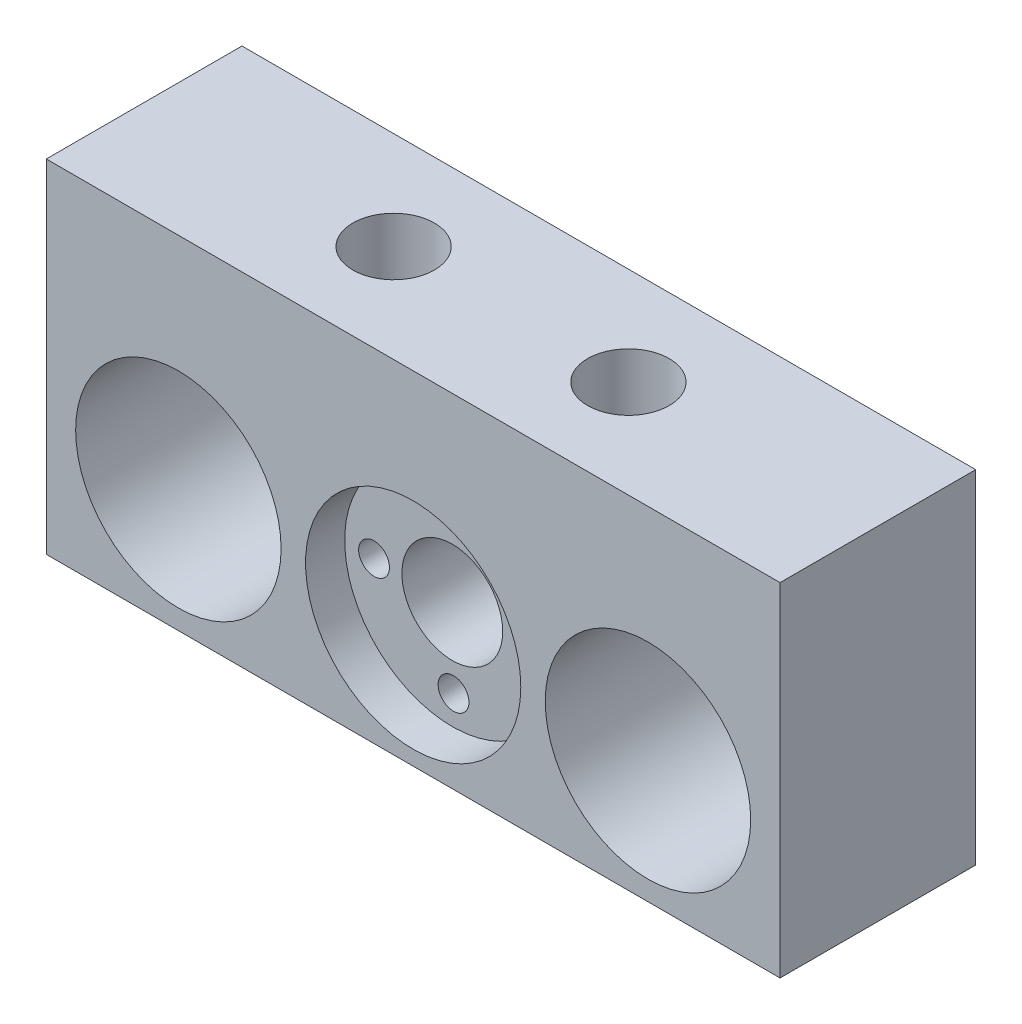
ISO-10303-21;
HEADER;
FILE_DESCRIPTION(('STEP AP214'),'2;1');
FILE_NAME('part.step','',(''),(''),'','','');
FILE_SCHEMA(('AUTOMOTIVE_DESIGN { 1 0 10303 214 1 1 1 1 }'));
ENDSEC;
DATA;
#1=APPLICATION_CONTEXT('core data for automotive mechanical design processes');
#2=APPLICATION_PROTOCOL_DEFINITION('international standard','automotive_design',2000,#1);
#3=PRODUCT_CONTEXT('',#1,'mechanical');
#4=PRODUCT('Part','Part','',(#3));
#5=PRODUCT_RELATED_PRODUCT_CATEGORY('part','',(#4));
#6=PRODUCT_DEFINITION_FORMATION('','',#4);
#7=PRODUCT_DEFINITION_CONTEXT('part definition',#1,'design');
#8=PRODUCT_DEFINITION('design','',#6,#7);
#9=PRODUCT_DEFINITION_SHAPE('','',#8);
#10=(LENGTH_UNIT() NAMED_UNIT(*) SI_UNIT(.MILLI.,.METRE.));
#11=(NAMED_UNIT(*) PLANE_ANGLE_UNIT() SI_UNIT($,.RADIAN.));
#12=(NAMED_UNIT(*) SI_UNIT($,.STERADIAN.) SOLID_ANGLE_UNIT());
#13=UNCERTAINTY_MEASURE_WITH_UNIT(LENGTH_MEASURE(1.E-05),#10,'distance_accuracy_value','');
#14=(GEOMETRIC_REPRESENTATION_CONTEXT(3) GLOBAL_UNCERTAINTY_ASSIGNED_CONTEXT((#13)) GLOBAL_UNIT_ASSIGNED_CONTEXT((#10,
#11,#12)) REPRESENTATION_CONTEXT('',''));
#15=CARTESIAN_POINT('',(0.,0.,0.));
#16=DIRECTION('',(0.,0.,1.));
#17=DIRECTION('',(1.,0.,0.));
#18=AXIS2_PLACEMENT_3D('',#15,#16,#17);
#19=CARTESIAN_POINT('',(0.,-5.,0.));
#20=DIRECTION('',(0.,0.,1.));
#21=DIRECTION('',(1.,0.,0.));
#22=AXIS2_PLACEMENT_3D('',#19,#20,#21);
#23=CYLINDRICAL_SURFACE('',#22,5.15);
#24=CARTESIAN_POINT('',(0.,-5.,0.));
#25=DIRECTION('',(0.,0.,1.));
#26=DIRECTION('',(1.,0.,0.));
#27=AXIS2_PLACEMENT_3D('',#24,#25,#26);
#28=CIRCLE('',#27,5.15);
#29=CARTESIAN_POINT('',(5.15,-5.,0.));
#30=VERTEX_POINT('',#29);
#31=EDGE_CURVE('E163',#30,#30,#28,.T.);
#32=ORIENTED_EDGE('',*,*,#31,.F.);
#33=EDGE_LOOP('',(#32));
#34=FACE_BOUND('',#33,.T.);
#35=CARTESIAN_POINT('',(0.,-5.,16.));
#36=DIRECTION('',(0.,0.,1.));
#37=DIRECTION('',(1.,0.,0.));
#38=AXIS2_PLACEMENT_3D('',#35,#36,#37);
#39=CIRCLE('',#38,5.15);
#40=CARTESIAN_POINT('',(5.15,-5.,16.));
#41=VERTEX_POINT('',#40);
#42=EDGE_CURVE('E41',#41,#41,#39,.F.);
#43=ORIENTED_EDGE('',*,*,#42,.F.);
#44=EDGE_LOOP('',(#43));
#45=FACE_BOUND('',#44,.T.);
#46=ADVANCED_FACE('F37',(#34,#45),#23,.F.);
#47=CARTESIAN_POINT('',(-37.5,-17.5,20.));
#48=DIRECTION('',(1.,0.,0.));
#49=DIRECTION('',(0.,0.,-1.));
#50=AXIS2_PLACEMENT_3D('',#47,#48,#49);
#51=PLANE('',#50);
#52=DIRECTION('',(0.,-1.,0.));
#53=VECTOR('',#52,1.);
#54=CARTESIAN_POINT('',(-37.5,-17.5,0.));
#55=LINE('',#54,#53);
#56=CARTESIAN_POINT('',(-37.5,17.5,0.));
#57=VERTEX_POINT('',#56);
#58=CARTESIAN_POINT('',(-37.5,-17.5,0.));
#59=VERTEX_POINT('',#58);
#60=EDGE_CURVE('E159',#57,#59,#55,.T.);
#61=ORIENTED_EDGE('',*,*,#60,.T.);
#62=DIRECTION('',(0.,0.,-1.));
#63=VECTOR('',#62,1.);
#64=CARTESIAN_POINT('',(-37.5,-17.5,20.));
#65=LINE('',#64,#63);
#66=CARTESIAN_POINT('',(-37.5,-17.5,20.));
#67=VERTEX_POINT('',#66);
#68=EDGE_CURVE('E11',#67,#59,#65,.T.);
#69=ORIENTED_EDGE('',*,*,#68,.F.);
#70=DIRECTION('',(0.,-1.,0.));
#71=VECTOR('',#70,1.);
#72=CARTESIAN_POINT('',(-37.5,-17.5,20.));
#73=LINE('',#72,#71);
#74=CARTESIAN_POINT('',(-37.5,17.5,20.));
#75=VERTEX_POINT('',#74);
#76=EDGE_CURVE('E172',#75,#67,#73,.T.);
#77=ORIENTED_EDGE('',*,*,#76,.F.);
#78=DIRECTION('',(0.,0.,-1.));
#79=VECTOR('',#78,1.);
#80=CARTESIAN_POINT('',(-37.5,17.5,20.));
#81=LINE('',#80,#79);
#82=EDGE_CURVE('E178',#75,#57,#81,.T.);
#83=ORIENTED_EDGE('',*,*,#82,.T.);
#84=EDGE_LOOP('',(#61,#69,#77,#83));
#85=FACE_BOUND('',#84,.T.);
#86=ADVANCED_FACE('F39',(#85),#51,.F.);
#87=CARTESIAN_POINT('',(37.5,-17.5,20.));
#88=DIRECTION('',(0.,1.,0.));
#89=DIRECTION('',(-1.,0.,0.));
#90=AXIS2_PLACEMENT_3D('',#87,#88,#89);
#91=PLANE('',#90);
#92=DIRECTION('',(1.,0.,0.));
#93=VECTOR('',#92,1.);
#94=CARTESIAN_POINT('',(37.5,-17.5,0.));
#95=LINE('',#94,#93);
#96=CARTESIAN_POINT('',(37.5,-17.5,0.));
#97=VERTEX_POINT('',#96);
#98=EDGE_CURVE('E181',#59,#97,#95,.T.);
#99=ORIENTED_EDGE('',*,*,#98,.T.);
#100=DIRECTION('',(0.,0.,-1.));
#101=VECTOR('',#100,1.);
#102=CARTESIAN_POINT('',(37.5,-17.5,20.));
#103=LINE('',#102,#101);
#104=CARTESIAN_POINT('',(37.5,-17.5,20.));
#105=VERTEX_POINT('',#104);
#106=EDGE_CURVE('E47',#105,#97,#103,.T.);
#107=ORIENTED_EDGE('',*,*,#106,.F.);
#108=DIRECTION('',(1.,0.,0.));
#109=VECTOR('',#108,1.);
#110=CARTESIAN_POINT('',(37.5,-17.5,20.));
#111=LINE('',#110,#109);
#112=EDGE_CURVE('E86',#67,#105,#111,.T.);
#113=ORIENTED_EDGE('',*,*,#112,.F.);
#114=ORIENTED_EDGE('',*,*,#68,.T.);
#115=EDGE_LOOP('',(#99,#107,#113,#114));
#116=FACE_BOUND('',#115,.T.);
#117=ADVANCED_FACE('F207',(#116),#91,.F.);
#118=CARTESIAN_POINT('',(37.5,-17.5,20.));
#119=DIRECTION('',(-1.,0.,0.));
#120=DIRECTION('',(0.,0.,1.));
#121=AXIS2_PLACEMENT_3D('',#118,#119,#120);
#122=PLANE('',#121);
#123=DIRECTION('',(0.,1.,0.));
#124=VECTOR('',#123,1.);
#125=CARTESIAN_POINT('',(37.5,-17.5,0.));
#126=LINE('',#125,#124);
#127=CARTESIAN_POINT('',(37.5,17.5,0.));
#128=VERTEX_POINT('',#127);
#129=EDGE_CURVE('E73',#97,#128,#126,.T.);
#130=ORIENTED_EDGE('',*,*,#129,.T.);
#131=DIRECTION('',(0.,0.,-1.));
#132=VECTOR('',#131,1.);
#133=CARTESIAN_POINT('',(37.5,17.5,20.));
#134=LINE('',#133,#132);
#135=CARTESIAN_POINT('',(37.5,17.5,20.));
#136=VERTEX_POINT('',#135);
#137=EDGE_CURVE('E186',#136,#128,#134,.T.);
#138=ORIENTED_EDGE('',*,*,#137,.F.);
#139=DIRECTION('',(0.,1.,0.));
#140=VECTOR('',#139,1.);
#141=CARTESIAN_POINT('',(37.5,-17.5,20.));
#142=LINE('',#141,#140);
#143=EDGE_CURVE('E175',#105,#136,#142,.T.);
#144=ORIENTED_EDGE('',*,*,#143,.F.);
#145=ORIENTED_EDGE('',*,*,#106,.T.);
#146=EDGE_LOOP('',(#130,#138,#144,#145));
#147=FACE_BOUND('',#146,.T.);
#148=ADVANCED_FACE('F189',(#147),#122,.F.);
#149=CARTESIAN_POINT('',(37.5,17.5,20.));
#150=DIRECTION('',(0.,-1.,0.));
#151=DIRECTION('',(1.,0.,0.));
#152=AXIS2_PLACEMENT_3D('',#149,#150,#151);
#153=PLANE('',#152);
#154=CARTESIAN_POINT('',(-12.,17.5,10.));
#155=DIRECTION('',(0.,1.,0.));
#156=DIRECTION('',(0.,0.,1.));
#157=AXIS2_PLACEMENT_3D('',#154,#155,#156);
#158=CIRCLE('',#157,4.16687);
#159=CARTESIAN_POINT('',(-12.,17.5,14.16687));
#160=VERTEX_POINT('',#159);
#161=EDGE_CURVE('E116',#160,#160,#158,.T.);
#162=ORIENTED_EDGE('',*,*,#161,.F.);
#163=EDGE_LOOP('',(#162));
#164=FACE_BOUND('',#163,.T.);
#165=CARTESIAN_POINT('',(12.,17.5,10.));
#166=DIRECTION('',(0.,1.,0.));
#167=DIRECTION('',(0.,0.,1.));
#168=AXIS2_PLACEMENT_3D('',#165,#166,#167);
#169=CIRCLE('',#168,4.16687);
#170=CARTESIAN_POINT('',(12.,17.5,14.16687));
#171=VERTEX_POINT('',#170);
#172=EDGE_CURVE('E115',#171,#171,#169,.T.);
#173=ORIENTED_EDGE('',*,*,#172,.F.);
#174=EDGE_LOOP('',(#173));
#175=FACE_BOUND('',#174,.T.);
#176=DIRECTION('',(-1.,0.,0.));
#177=VECTOR('',#176,1.);
#178=CARTESIAN_POINT('',(37.5,17.5,0.));
#179=LINE('',#178,#177);
#180=EDGE_CURVE('E79',#128,#57,#179,.T.);
#181=ORIENTED_EDGE('',*,*,#180,.T.);
#182=ORIENTED_EDGE('',*,*,#82,.F.);
#183=DIRECTION('',(-1.,0.,0.));
#184=VECTOR('',#183,1.);
#185=CARTESIAN_POINT('',(37.5,17.5,20.));
#186=LINE('',#185,#184);
#187=EDGE_CURVE('E55',#136,#75,#186,.T.);
#188=ORIENTED_EDGE('',*,*,#187,.F.);
#189=ORIENTED_EDGE('',*,*,#137,.T.);
#190=EDGE_LOOP('',(#181,#182,#188,#189));
#191=FACE_BOUND('',#190,.T.);
#192=ADVANCED_FACE('F196',(#164,#175,#191),#153,.F.);
#193=CARTESIAN_POINT('',(0.,0.,20.));
#194=DIRECTION('',(0.,0.,1.));
#195=DIRECTION('',(1.,0.,0.));
#196=AXIS2_PLACEMENT_3D('',#193,#194,#195);
#197=PLANE('',#196);
#198=CARTESIAN_POINT('',(0.,-5.,20.));
#199=DIRECTION('',(0.,0.,1.));
#200=DIRECTION('',(1.,0.,0.));
#201=AXIS2_PLACEMENT_3D('',#198,#199,#200);
#202=CIRCLE('',#201,11.);
#203=CARTESIAN_POINT('',(11.,-5.,20.));
#204=VERTEX_POINT('',#203);
#205=EDGE_CURVE('E150',#204,#204,#202,.T.);
#206=ORIENTED_EDGE('',*,*,#205,.F.);
#207=EDGE_LOOP('',(#206));
#208=FACE_BOUND('',#207,.T.);
#209=CARTESIAN_POINT('',(-24.,-5.,20.));
#210=DIRECTION('',(0.,0.,1.));
#211=DIRECTION('',(1.,0.,0.));
#212=AXIS2_PLACEMENT_3D('',#209,#210,#211);
#213=CIRCLE('',#212,10.5);
#214=CARTESIAN_POINT('',(-13.5,-5.,20.));
#215=VERTEX_POINT('',#214);
#216=EDGE_CURVE('E160',#215,#215,#213,.T.);
#217=ORIENTED_EDGE('',*,*,#216,.F.);
#218=EDGE_LOOP('',(#217));
#219=FACE_BOUND('',#218,.T.);
#220=CARTESIAN_POINT('',(24.,-5.,20.));
#221=DIRECTION('',(0.,0.,1.));
#222=DIRECTION('',(-1.,0.,0.));
#223=AXIS2_PLACEMENT_3D('',#220,#221,#222);
#224=CIRCLE('',#223,10.5);
#225=CARTESIAN_POINT('',(13.5,-5.,20.));
#226=VERTEX_POINT('',#225);
#227=EDGE_CURVE('E169',#226,#226,#224,.T.);
#228=ORIENTED_EDGE('',*,*,#227,.F.);
#229=EDGE_LOOP('',(#228));
#230=FACE_BOUND('',#229,.T.);
#231=ORIENTED_EDGE('',*,*,#76,.T.);
#232=ORIENTED_EDGE('',*,*,#112,.T.);
#233=ORIENTED_EDGE('',*,*,#143,.T.);
#234=ORIENTED_EDGE('',*,*,#187,.T.);
#235=EDGE_LOOP('',(#231,#232,#233,#234));
#236=FACE_BOUND('',#235,.T.);
#237=ADVANCED_FACE('F198',(#208,#219,#230,#236),#197,.T.);
#238=CARTESIAN_POINT('',(0.,0.,0.));
#239=DIRECTION('',(0.,0.,1.));
#240=DIRECTION('',(1.,0.,0.));
#241=AXIS2_PLACEMENT_3D('',#238,#239,#240);
#242=PLANE('',#241);
#243=CARTESIAN_POINT('',(-24.,-5.,0.));
#244=DIRECTION('',(0.,0.,1.));
#245=DIRECTION('',(1.,0.,0.));
#246=AXIS2_PLACEMENT_3D('',#243,#244,#245);
#247=CIRCLE('',#246,10.5);
#248=CARTESIAN_POINT('',(-13.5,-5.,0.));
#249=VERTEX_POINT('',#248);
#250=EDGE_CURVE('E156',#249,#249,#247,.T.);
#251=ORIENTED_EDGE('',*,*,#250,.T.);
#252=EDGE_LOOP('',(#251));
#253=FACE_BOUND('',#252,.T.);
#254=ORIENTED_EDGE('',*,*,#31,.T.);
#255=EDGE_LOOP('',(#254));
#256=FACE_BOUND('',#255,.T.);
#257=CARTESIAN_POINT('',(24.,-5.,0.));
#258=DIRECTION('',(0.,0.,1.));
#259=DIRECTION('',(-1.,0.,0.));
#260=AXIS2_PLACEMENT_3D('',#257,#258,#259);
#261=CIRCLE('',#260,10.5);
#262=CARTESIAN_POINT('',(13.5,-5.,0.));
#263=VERTEX_POINT('',#262);
#264=EDGE_CURVE('E166',#263,#263,#261,.T.);
#265=ORIENTED_EDGE('',*,*,#264,.T.);
#266=EDGE_LOOP('',(#265));
#267=FACE_BOUND('',#266,.T.);
#268=ORIENTED_EDGE('',*,*,#60,.F.);
#269=ORIENTED_EDGE('',*,*,#180,.F.);
#270=ORIENTED_EDGE('',*,*,#129,.F.);
#271=ORIENTED_EDGE('',*,*,#98,.F.);
#272=EDGE_LOOP('',(#268,#269,#270,#271));
#273=FACE_BOUND('',#272,.T.);
#274=ADVANCED_FACE('F192',(#253,#256,#267,#273),#242,.F.);
#275=CARTESIAN_POINT('',(24.,-5.,0.));
#276=DIRECTION('',(0.,0.,1.));
#277=DIRECTION('',(1.,0.,0.));
#278=AXIS2_PLACEMENT_3D('',#275,#276,#277);
#279=CYLINDRICAL_SURFACE('',#278,10.5);
#280=ORIENTED_EDGE('',*,*,#264,.F.);
#281=EDGE_LOOP('',(#280));
#282=FACE_BOUND('',#281,.T.);
#283=ORIENTED_EDGE('',*,*,#227,.T.);
#284=EDGE_LOOP('',(#283));
#285=FACE_BOUND('',#284,.T.);
#286=ADVANCED_FACE('F224',(#282,#285),#279,.F.);
#287=CARTESIAN_POINT('',(-24.,-5.,0.));
#288=DIRECTION('',(0.,0.,1.));
#289=DIRECTION('',(1.,0.,0.));
#290=AXIS2_PLACEMENT_3D('',#287,#288,#289);
#291=CYLINDRICAL_SURFACE('',#290,10.5);
#292=ORIENTED_EDGE('',*,*,#250,.F.);
#293=EDGE_LOOP('',(#292));
#294=FACE_BOUND('',#293,.T.);
#295=ORIENTED_EDGE('',*,*,#216,.T.);
#296=EDGE_LOOP('',(#295));
#297=FACE_BOUND('',#296,.T.);
#298=ADVANCED_FACE('F222',(#294,#297),#291,.F.);
#299=CARTESIAN_POINT('',(0.,-5.,16.));
#300=DIRECTION('',(0.,0.,1.));
#301=DIRECTION('',(1.,0.,0.));
#302=AXIS2_PLACEMENT_3D('',#299,#300,#301);
#303=PLANE('',#302);
#304=CARTESIAN_POINT('',(-8.,-5.12563555532117,16.));
#305=DIRECTION('',(0.,0.,1.));
#306=DIRECTION('',(1.,0.,0.));
#307=AXIS2_PLACEMENT_3D('',#304,#305,#306);
#308=CIRCLE('',#307,1.575);
#309=CARTESIAN_POINT('',(-6.425,-5.12563555532117,16.));
#310=VERTEX_POINT('',#309);
#311=EDGE_CURVE('E126',#310,#310,#308,.T.);
#312=ORIENTED_EDGE('',*,*,#311,.F.);
#313=EDGE_LOOP('',(#312));
#314=FACE_BOUND('',#313,.T.);
#315=CARTESIAN_POINT('',(-0.125635555321142,3.,16.));
#316=DIRECTION('',(0.,0.,1.));
#317=DIRECTION('',(1.,0.,0.));
#318=AXIS2_PLACEMENT_3D('',#315,#316,#317);
#319=CIRCLE('',#318,1.575);
#320=CARTESIAN_POINT('',(1.44936444467886,3.,16.));
#321=VERTEX_POINT('',#320);
#322=EDGE_CURVE('E132',#321,#321,#319,.T.);
#323=ORIENTED_EDGE('',*,*,#322,.F.);
#324=EDGE_LOOP('',(#323));
#325=FACE_BOUND('',#324,.T.);
#326=CARTESIAN_POINT('',(8.,-4.87436444467889,16.));
#327=DIRECTION('',(0.,0.,1.));
#328=DIRECTION('',(1.,0.,0.));
#329=AXIS2_PLACEMENT_3D('',#326,#327,#328);
#330=CIRCLE('',#329,1.575);
#331=CARTESIAN_POINT('',(9.575,-4.87436444467889,16.));
#332=VERTEX_POINT('',#331);
#333=EDGE_CURVE('E138',#332,#332,#330,.T.);
#334=ORIENTED_EDGE('',*,*,#333,.F.);
#335=EDGE_LOOP('',(#334));
#336=FACE_BOUND('',#335,.T.);
#337=CARTESIAN_POINT('',(0.125635555321082,-13.,16.));
#338=DIRECTION('',(0.,0.,1.));
#339=DIRECTION('',(1.,0.,0.));
#340=AXIS2_PLACEMENT_3D('',#337,#338,#339);
#341=CIRCLE('',#340,1.575);
#342=CARTESIAN_POINT('',(1.70063555532108,-13.,16.));
#343=VERTEX_POINT('',#342);
#344=EDGE_CURVE('E144',#343,#343,#341,.T.);
#345=ORIENTED_EDGE('',*,*,#344,.F.);
#346=EDGE_LOOP('',(#345));
#347=FACE_BOUND('',#346,.T.);
#348=CARTESIAN_POINT('',(0.,-5.,16.));
#349=DIRECTION('',(0.,0.,1.));
#350=DIRECTION('',(1.,0.,0.));
#351=AXIS2_PLACEMENT_3D('',#348,#349,#350);
#352=CIRCLE('',#351,11.);
#353=CARTESIAN_POINT('',(11.,-5.,16.));
#354=VERTEX_POINT('',#353);
#355=EDGE_CURVE('E151',#354,#354,#352,.T.);
#356=ORIENTED_EDGE('',*,*,#355,.T.);
#357=EDGE_LOOP('',(#356));
#358=FACE_BOUND('',#357,.T.);
#359=ORIENTED_EDGE('',*,*,#42,.T.);
#360=EDGE_LOOP('',(#359));
#361=FACE_BOUND('',#360,.T.);
#362=ADVANCED_FACE('F241',(#314,#325,#336,#347,#358,#361),#303,.T.);
#363=CARTESIAN_POINT('',(0.,-5.,16.));
#364=DIRECTION('',(0.,0.,1.));
#365=DIRECTION('',(1.,0.,0.));
#366=AXIS2_PLACEMENT_3D('',#363,#364,#365);
#367=CYLINDRICAL_SURFACE('',#366,11.);
#368=ORIENTED_EDGE('',*,*,#355,.F.);
#369=EDGE_LOOP('',(#368));
#370=FACE_BOUND('',#369,.T.);
#371=ORIENTED_EDGE('',*,*,#205,.T.);
#372=EDGE_LOOP('',(#371));
#373=FACE_BOUND('',#372,.T.);
#374=ADVANCED_FACE('F247',(#370,#373),#367,.F.);
#375=CARTESIAN_POINT('',(0.125635555321082,-13.,6.));
#376=DIRECTION('',(0.,0.,1.));
#377=DIRECTION('',(1.,0.,0.));
#378=AXIS2_PLACEMENT_3D('',#375,#376,#377);
#379=CONICAL_SURFACE('',#378,1.575,1.02974425867665);
#380=CARTESIAN_POINT('',(0.12563555532108,-13.,5.05364452503159));
#381=VERTEX_POINT('',#380);
#382=VERTEX_LOOP('',#381);
#383=FACE_BOUND('',#382,.T.);
#384=CARTESIAN_POINT('',(0.125635555321082,-13.,6.));
#385=DIRECTION('',(0.,0.,1.));
#386=DIRECTION('',(1.,0.,0.));
#387=AXIS2_PLACEMENT_3D('',#384,#385,#386);
#388=CIRCLE('',#387,1.575);
#389=CARTESIAN_POINT('',(1.70063555532108,-13.,6.));
#390=VERTEX_POINT('',#389);
#391=EDGE_CURVE('E147',#390,#390,#388,.T.);
#392=ORIENTED_EDGE('',*,*,#391,.T.);
#393=EDGE_LOOP('',(#392));
#394=FACE_BOUND('',#393,.T.);
#395=ADVANCED_FACE('F253',(#383,#394),#379,.F.);
#396=CARTESIAN_POINT('',(0.125635555321082,-13.,16.));
#397=DIRECTION('',(0.,0.,1.));
#398=DIRECTION('',(1.,0.,0.));
#399=AXIS2_PLACEMENT_3D('',#396,#397,#398);
#400=CYLINDRICAL_SURFACE('',#399,1.575);
#401=ORIENTED_EDGE('',*,*,#391,.F.);
#402=EDGE_LOOP('',(#401));
#403=FACE_BOUND('',#402,.T.);
#404=ORIENTED_EDGE('',*,*,#344,.T.);
#405=EDGE_LOOP('',(#404));
#406=FACE_BOUND('',#405,.T.);
#407=ADVANCED_FACE('F260',(#403,#406),#400,.F.);
#408=CARTESIAN_POINT('',(8.,-4.87436444467889,6.));
#409=DIRECTION('',(0.,0.,1.));
#410=DIRECTION('',(1.,0.,0.));
#411=AXIS2_PLACEMENT_3D('',#408,#409,#410);
#412=CONICAL_SURFACE('',#411,1.575,1.02974425867665);
#413=CARTESIAN_POINT('',(7.99999999999999,-4.87436444467889,5.05364452503159));
#414=VERTEX_POINT('',#413);
#415=VERTEX_LOOP('',#414);
#416=FACE_BOUND('',#415,.T.);
#417=CARTESIAN_POINT('',(8.,-4.87436444467889,6.));
#418=DIRECTION('',(0.,0.,1.));
#419=DIRECTION('',(1.,0.,0.));
#420=AXIS2_PLACEMENT_3D('',#417,#418,#419);
#421=CIRCLE('',#420,1.575);
#422=CARTESIAN_POINT('',(9.575,-4.87436444467889,6.));
#423=VERTEX_POINT('',#422);
#424=EDGE_CURVE('E141',#423,#423,#421,.T.);
#425=ORIENTED_EDGE('',*,*,#424,.T.);
#426=EDGE_LOOP('',(#425));
#427=FACE_BOUND('',#426,.T.);
#428=ADVANCED_FACE('F264',(#416,#427),#412,.F.);
#429=CARTESIAN_POINT('',(8.,-4.87436444467889,16.));
#430=DIRECTION('',(0.,0.,1.));
#431=DIRECTION('',(1.,0.,0.));
#432=AXIS2_PLACEMENT_3D('',#429,#430,#431);
#433=CYLINDRICAL_SURFACE('',#432,1.575);
#434=ORIENTED_EDGE('',*,*,#424,.F.);
#435=EDGE_LOOP('',(#434));
#436=FACE_BOUND('',#435,.T.);
#437=ORIENTED_EDGE('',*,*,#333,.T.);
#438=EDGE_LOOP('',(#437));
#439=FACE_BOUND('',#438,.T.);
#440=ADVANCED_FACE('F268',(#436,#439),#433,.F.);
#441=CARTESIAN_POINT('',(-0.125635555321142,3.,6.));
#442=DIRECTION('',(0.,0.,1.));
#443=DIRECTION('',(1.,0.,0.));
#444=AXIS2_PLACEMENT_3D('',#441,#442,#443);
#445=CONICAL_SURFACE('',#444,1.575,1.02974425867665);
#446=CARTESIAN_POINT('',(-0.125635555321145,3.,5.05364452503159));
#447=VERTEX_POINT('',#446);
#448=VERTEX_LOOP('',#447);
#449=FACE_BOUND('',#448,.T.);
#450=CARTESIAN_POINT('',(-0.125635555321142,3.,6.));
#451=DIRECTION('',(0.,0.,1.));
#452=DIRECTION('',(1.,0.,0.));
#453=AXIS2_PLACEMENT_3D('',#450,#451,#452);
#454=CIRCLE('',#453,1.575);
#455=CARTESIAN_POINT('',(1.44936444467886,3.,6.));
#456=VERTEX_POINT('',#455);
#457=EDGE_CURVE('E135',#456,#456,#454,.T.);
#458=ORIENTED_EDGE('',*,*,#457,.T.);
#459=EDGE_LOOP('',(#458));
#460=FACE_BOUND('',#459,.T.);
#461=ADVANCED_FACE('F272',(#449,#460),#445,.F.);
#462=CARTESIAN_POINT('',(-0.125635555321142,3.,16.));
#463=DIRECTION('',(0.,0.,1.));
#464=DIRECTION('',(1.,0.,0.));
#465=AXIS2_PLACEMENT_3D('',#462,#463,#464);
#466=CYLINDRICAL_SURFACE('',#465,1.575);
#467=ORIENTED_EDGE('',*,*,#457,.F.);
#468=EDGE_LOOP('',(#467));
#469=FACE_BOUND('',#468,.T.);
#470=ORIENTED_EDGE('',*,*,#322,.T.);
#471=EDGE_LOOP('',(#470));
#472=FACE_BOUND('',#471,.T.);
#473=ADVANCED_FACE('F276',(#469,#472),#466,.F.);
#474=CARTESIAN_POINT('',(-8.,-5.12563555532117,6.));
#475=DIRECTION('',(0.,0.,1.));
#476=DIRECTION('',(1.,0.,0.));
#477=AXIS2_PLACEMENT_3D('',#474,#475,#476);
#478=CONICAL_SURFACE('',#477,1.575,1.02974425867665);
#479=CARTESIAN_POINT('',(-8.,-5.12563555532117,5.05364452503159));
#480=VERTEX_POINT('',#479);
#481=VERTEX_LOOP('',#480);
#482=FACE_BOUND('',#481,.T.);
#483=CARTESIAN_POINT('',(-8.,-5.12563555532117,6.));
#484=DIRECTION('',(0.,0.,1.));
#485=DIRECTION('',(1.,0.,0.));
#486=AXIS2_PLACEMENT_3D('',#483,#484,#485);
#487=CIRCLE('',#486,1.575);
#488=CARTESIAN_POINT('',(-6.425,-5.12563555532117,6.));
#489=VERTEX_POINT('',#488);
#490=EDGE_CURVE('E129',#489,#489,#487,.T.);
#491=ORIENTED_EDGE('',*,*,#490,.T.);
#492=EDGE_LOOP('',(#491));
#493=FACE_BOUND('',#492,.T.);
#494=ADVANCED_FACE('F280',(#482,#493),#478,.F.);
#495=CARTESIAN_POINT('',(-8.,-5.12563555532117,16.));
#496=DIRECTION('',(0.,0.,1.));
#497=DIRECTION('',(1.,0.,0.));
#498=AXIS2_PLACEMENT_3D('',#495,#496,#497);
#499=CYLINDRICAL_SURFACE('',#498,1.575);
#500=ORIENTED_EDGE('',*,*,#490,.F.);
#501=EDGE_LOOP('',(#500));
#502=FACE_BOUND('',#501,.T.);
#503=ORIENTED_EDGE('',*,*,#311,.T.);
#504=EDGE_LOOP('',(#503));
#505=FACE_BOUND('',#504,.T.);
#506=ADVANCED_FACE('F284',(#502,#505),#499,.F.);
#507=CARTESIAN_POINT('',(12.,5.50000000000001,10.));
#508=DIRECTION('',(0.,1.,0.));
#509=DIRECTION('',(0.,0.,1.));
#510=AXIS2_PLACEMENT_3D('',#507,#508,#509);
#511=CONICAL_SURFACE('',#510,4.16687,1.02974425867665);
#512=CARTESIAN_POINT('',(12.,2.99629191239263,10.));
#513=VERTEX_POINT('',#512);
#514=VERTEX_LOOP('',#513);
#515=FACE_BOUND('',#514,.T.);
#516=CARTESIAN_POINT('',(12.,5.50000000000001,10.));
#517=DIRECTION('',(0.,1.,0.));
#518=DIRECTION('',(0.,0.,1.));
#519=AXIS2_PLACEMENT_3D('',#516,#517,#518);
#520=CIRCLE('',#519,4.16687);
#521=CARTESIAN_POINT('',(12.,5.50000000000001,14.16687));
#522=VERTEX_POINT('',#521);
#523=EDGE_CURVE('E119',#522,#522,#520,.T.);
#524=ORIENTED_EDGE('',*,*,#523,.T.);
#525=EDGE_LOOP('',(#524));
#526=FACE_BOUND('',#525,.T.);
#527=ADVANCED_FACE('F288',(#515,#526),#511,.F.);
#528=CARTESIAN_POINT('',(12.,17.5,10.));
#529=DIRECTION('',(0.,1.,0.));
#530=DIRECTION('',(0.,0.,1.));
#531=AXIS2_PLACEMENT_3D('',#528,#529,#530);
#532=CYLINDRICAL_SURFACE('',#531,4.16687);
#533=ORIENTED_EDGE('',*,*,#523,.F.);
#534=EDGE_LOOP('',(#533));
#535=FACE_BOUND('',#534,.T.);
#536=ORIENTED_EDGE('',*,*,#172,.T.);
#537=EDGE_LOOP('',(#536));
#538=FACE_BOUND('',#537,.T.);
#539=ADVANCED_FACE('F109',(#535,#538),#532,.F.);
#540=CARTESIAN_POINT('',(-12.,5.50000000000001,10.));
#541=DIRECTION('',(0.,1.,0.));
#542=DIRECTION('',(0.,0.,1.));
#543=AXIS2_PLACEMENT_3D('',#540,#541,#542);
#544=CONICAL_SURFACE('',#543,4.16687,1.02974425867665);
#545=CARTESIAN_POINT('',(-12.,2.99629191239263,10.));
#546=VERTEX_POINT('',#545);
#547=VERTEX_LOOP('',#546);
#548=FACE_BOUND('',#547,.T.);
#549=CARTESIAN_POINT('',(-12.,5.50000000000001,10.));
#550=DIRECTION('',(0.,1.,0.));
#551=DIRECTION('',(0.,0.,1.));
#552=AXIS2_PLACEMENT_3D('',#549,#550,#551);
#553=CIRCLE('',#552,4.16687);
#554=CARTESIAN_POINT('',(-12.,5.50000000000001,14.16687));
#555=VERTEX_POINT('',#554);
#556=EDGE_CURVE('E113',#555,#555,#553,.T.);
#557=ORIENTED_EDGE('',*,*,#556,.T.);
#558=EDGE_LOOP('',(#557));
#559=FACE_BOUND('',#558,.T.);
#560=ADVANCED_FACE('F105',(#548,#559),#544,.F.);
#561=CARTESIAN_POINT('',(-12.,17.5,10.));
#562=DIRECTION('',(0.,1.,0.));
#563=DIRECTION('',(0.,0.,1.));
#564=AXIS2_PLACEMENT_3D('',#561,#562,#563);
#565=CYLINDRICAL_SURFACE('',#564,4.16687);
#566=ORIENTED_EDGE('',*,*,#556,.F.);
#567=EDGE_LOOP('',(#566));
#568=FACE_BOUND('',#567,.T.);
#569=ORIENTED_EDGE('',*,*,#161,.T.);
#570=EDGE_LOOP('',(#569));
#571=FACE_BOUND('',#570,.T.);
#572=ADVANCED_FACE('F108',(#568,#571),#565,.F.);
#573=CLOSED_SHELL('',(#46,#86,#117,#148,#192,#237,#274,#286,#298,#362,#374,#395,#407,#428,#440,
#461,#473,#494,#506,#527,#539,#560,#572));
#574=MANIFOLD_SOLID_BREP('B2',#573);
#575=ADVANCED_BREP_SHAPE_REPRESENTATION('',(#18,#574),#14);
#576=SHAPE_DEFINITION_REPRESENTATION(#9,#575);
ENDSEC;
END-ISO-10303-21;
